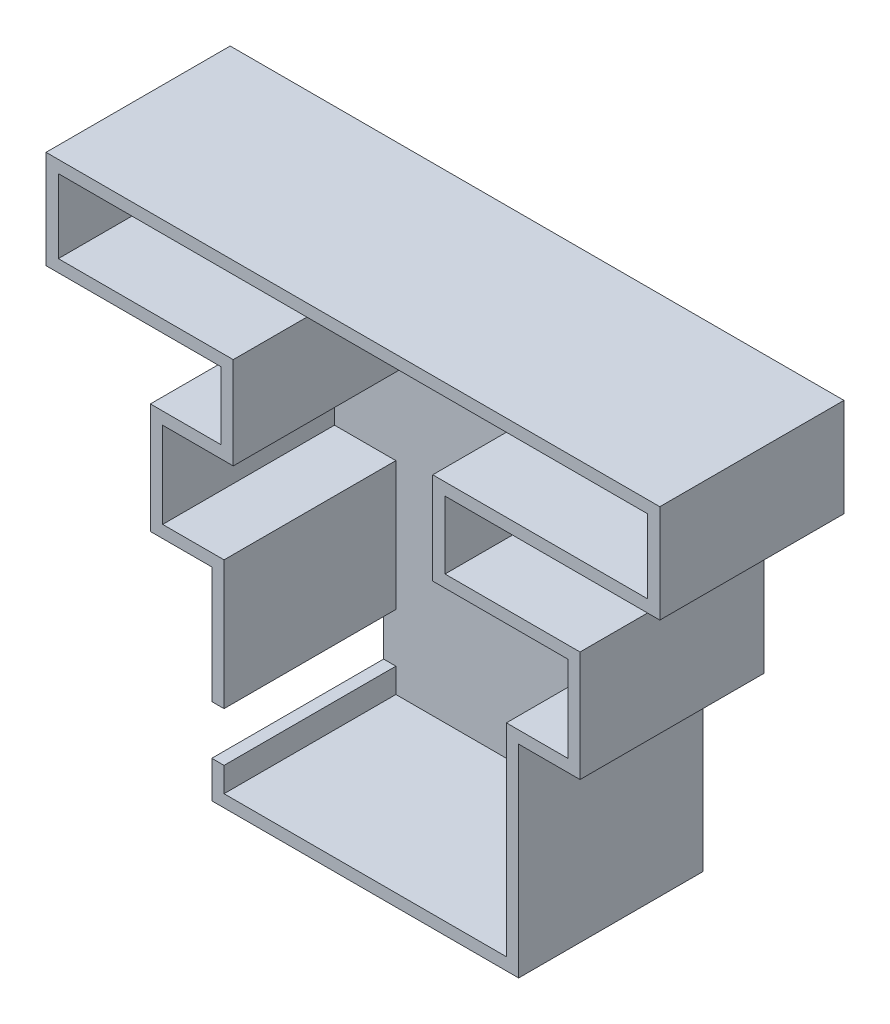
ISO-10303-21;
HEADER;
FILE_DESCRIPTION(('STEP AP214'),'2;1');
FILE_NAME('part.step','',(''),(''),'','','');
FILE_SCHEMA(('AUTOMOTIVE_DESIGN { 1 0 10303 214 1 1 1 1 }'));
ENDSEC;
DATA;
#1=APPLICATION_CONTEXT('core data for automotive mechanical design processes');
#2=APPLICATION_PROTOCOL_DEFINITION('international standard','automotive_design',2000,#1);
#3=PRODUCT_CONTEXT('',#1,'mechanical');
#4=PRODUCT('Part','Part','',(#3));
#5=PRODUCT_RELATED_PRODUCT_CATEGORY('part','',(#4));
#6=PRODUCT_DEFINITION_FORMATION('','',#4);
#7=PRODUCT_DEFINITION_CONTEXT('part definition',#1,'design');
#8=PRODUCT_DEFINITION('design','',#6,#7);
#9=PRODUCT_DEFINITION_SHAPE('','',#8);
#10=(LENGTH_UNIT() NAMED_UNIT(*) SI_UNIT(.MILLI.,.METRE.));
#11=(NAMED_UNIT(*) PLANE_ANGLE_UNIT() SI_UNIT($,.RADIAN.));
#12=(NAMED_UNIT(*) SI_UNIT($,.STERADIAN.) SOLID_ANGLE_UNIT());
#13=UNCERTAINTY_MEASURE_WITH_UNIT(LENGTH_MEASURE(1.E-05),#10,'distance_accuracy_value','');
#14=(GEOMETRIC_REPRESENTATION_CONTEXT(3) GLOBAL_UNCERTAINTY_ASSIGNED_CONTEXT((#13)) GLOBAL_UNIT_ASSIGNED_CONTEXT((#10,
#11,#12)) REPRESENTATION_CONTEXT('',''));
#15=CARTESIAN_POINT('',(0.,0.,0.));
#16=DIRECTION('',(0.,0.,1.));
#17=DIRECTION('',(1.,0.,0.));
#18=AXIS2_PLACEMENT_3D('',#15,#16,#17);
#19=CARTESIAN_POINT('',(-12.5,-1.,15.));
#20=DIRECTION('',(1.,0.,0.));
#21=DIRECTION('',(0.,0.,-1.));
#22=AXIS2_PLACEMENT_3D('',#19,#20,#21);
#23=PLANE('',#22);
#24=DIRECTION('',(0.,0.,1.));
#25=VECTOR('',#24,1.);
#26=CARTESIAN_POINT('',(-12.5,-10.5,1.));
#27=LINE('',#26,#25);
#28=CARTESIAN_POINT('',(-12.5,-10.5,1.));
#29=VERTEX_POINT('',#28);
#30=CARTESIAN_POINT('',(-12.5,-10.5,15.));
#31=VERTEX_POINT('',#30);
#32=EDGE_CURVE('E288',#29,#31,#27,.T.);
#33=ORIENTED_EDGE('',*,*,#32,.T.);
#34=DIRECTION('',(0.,-1.,0.));
#35=VECTOR('',#34,1.);
#36=CARTESIAN_POINT('',(-12.5,-1.,15.));
#37=LINE('',#36,#35);
#38=CARTESIAN_POINT('',(-12.5,-1.,15.));
#39=VERTEX_POINT('',#38);
#40=EDGE_CURVE('E306',#39,#31,#37,.T.);
#41=ORIENTED_EDGE('',*,*,#40,.F.);
#42=DIRECTION('',(0.,0.,-1.));
#43=VECTOR('',#42,1.);
#44=CARTESIAN_POINT('',(-12.5,-1.,15.));
#45=LINE('',#44,#43);
#46=CARTESIAN_POINT('',(-12.5,-1.,0.));
#47=VERTEX_POINT('',#46);
#48=EDGE_CURVE('E11',#39,#47,#45,.T.);
#49=ORIENTED_EDGE('',*,*,#48,.T.);
#50=DIRECTION('',(0.,-1.,0.));
#51=VECTOR('',#50,1.);
#52=CARTESIAN_POINT('',(-12.5,-1.,0.));
#53=LINE('',#52,#51);
#54=CARTESIAN_POINT('',(-12.5,-17.5,0.));
#55=VERTEX_POINT('',#54);
#56=EDGE_CURVE('E371',#47,#55,#53,.T.);
#57=ORIENTED_EDGE('',*,*,#56,.T.);
#58=DIRECTION('',(0.,0.,-1.));
#59=VECTOR('',#58,1.);
#60=CARTESIAN_POINT('',(-12.5,-17.5,15.));
#61=LINE('',#60,#59);
#62=CARTESIAN_POINT('',(-12.5,-17.5,15.));
#63=VERTEX_POINT('',#62);
#64=EDGE_CURVE('E54',#63,#55,#61,.T.);
#65=ORIENTED_EDGE('',*,*,#64,.F.);
#66=CARTESIAN_POINT('',(-12.5,-14.5,15.));
#67=VERTEX_POINT('',#66);
#68=EDGE_CURVE('E294',#67,#63,#37,.T.);
#69=ORIENTED_EDGE('',*,*,#68,.F.);
#70=DIRECTION('',(0.,0.,1.));
#71=VECTOR('',#70,1.);
#72=CARTESIAN_POINT('',(-12.5,-14.5,1.));
#73=LINE('',#72,#71);
#74=CARTESIAN_POINT('',(-12.5,-14.5,1.));
#75=VERTEX_POINT('',#74);
#76=EDGE_CURVE('E279',#75,#67,#73,.T.);
#77=ORIENTED_EDGE('',*,*,#76,.F.);
#78=DIRECTION('',(0.,-1.,0.));
#79=VECTOR('',#78,1.);
#80=CARTESIAN_POINT('',(-12.5,-10.5,1.));
#81=LINE('',#80,#79);
#82=EDGE_CURVE('E300',#29,#75,#81,.T.);
#83=ORIENTED_EDGE('',*,*,#82,.F.);
#84=EDGE_LOOP('',(#33,#41,#49,#57,#65,#69,#77,#83));
#85=FACE_BOUND('',#84,.T.);
#86=ADVANCED_FACE('F45',(#85),#23,.F.);
#87=CARTESIAN_POINT('',(0.,0.,15.));
#88=DIRECTION('',(0.,0.,-1.));
#89=DIRECTION('',(-1.,0.,0.));
#90=AXIS2_PLACEMENT_3D('',#87,#88,#89);
#91=PLANE('',#90);
#92=DIRECTION('',(-1.,0.,0.));
#93=VECTOR('',#92,1.);
#94=CARTESIAN_POINT('',(3.06021977856103,-10.5,15.));
#95=LINE('',#94,#93);
#96=CARTESIAN_POINT('',(-11.5,-10.5,15.));
#97=VERTEX_POINT('',#96);
#98=EDGE_CURVE('E299',#97,#31,#95,.T.);
#99=ORIENTED_EDGE('',*,*,#98,.F.);
#100=DIRECTION('',(0.,-1.,0.));
#101=VECTOR('',#100,1.);
#102=CARTESIAN_POINT('',(-11.5,0.,15.));
#103=LINE('',#102,#101);
#104=CARTESIAN_POINT('',(-11.5,0.,15.));
#105=VERTEX_POINT('',#104);
#106=EDGE_CURVE('E542',#105,#97,#103,.T.);
#107=ORIENTED_EDGE('',*,*,#106,.F.);
#108=DIRECTION('',(1.,0.,0.));
#109=VECTOR('',#108,1.);
#110=CARTESIAN_POINT('',(-16.5,0.,15.));
#111=LINE('',#110,#109);
#112=CARTESIAN_POINT('',(-16.5,0.,15.));
#113=VERTEX_POINT('',#112);
#114=EDGE_CURVE('E563',#113,#105,#111,.T.);
#115=ORIENTED_EDGE('',*,*,#114,.F.);
#116=DIRECTION('',(0.,-1.,0.));
#117=VECTOR('',#116,1.);
#118=CARTESIAN_POINT('',(-16.5,7.,15.));
#119=LINE('',#118,#117);
#120=CARTESIAN_POINT('',(-16.5,7.,15.));
#121=VERTEX_POINT('',#120);
#122=EDGE_CURVE('E672',#121,#113,#119,.T.);
#123=ORIENTED_EDGE('',*,*,#122,.F.);
#124=DIRECTION('',(-1.,0.,0.));
#125=VECTOR('',#124,1.);
#126=CARTESIAN_POINT('',(-10.75,7.,15.));
#127=LINE('',#126,#125);
#128=CARTESIAN_POINT('',(-10.75,7.,15.));
#129=VERTEX_POINT('',#128);
#130=EDGE_CURVE('E669',#129,#121,#127,.T.);
#131=ORIENTED_EDGE('',*,*,#130,.F.);
#132=DIRECTION('',(0.,-1.,0.));
#133=VECTOR('',#132,1.);
#134=CARTESIAN_POINT('',(-10.75,14.5,15.));
#135=LINE('',#134,#133);
#136=CARTESIAN_POINT('',(-10.75,14.5,15.));
#137=VERTEX_POINT('',#136);
#138=EDGE_CURVE('E665',#137,#129,#135,.T.);
#139=ORIENTED_EDGE('',*,*,#138,.F.);
#140=DIRECTION('',(1.,0.,0.));
#141=VECTOR('',#140,1.);
#142=CARTESIAN_POINT('',(-25.,14.5,15.));
#143=LINE('',#142,#141);
#144=CARTESIAN_POINT('',(-25.,14.5,15.));
#145=VERTEX_POINT('',#144);
#146=EDGE_CURVE('E661',#145,#137,#143,.T.);
#147=ORIENTED_EDGE('',*,*,#146,.F.);
#148=DIRECTION('',(0.,-1.,0.));
#149=VECTOR('',#148,1.);
#150=CARTESIAN_POINT('',(-25.,20.5,15.));
#151=LINE('',#150,#149);
#152=CARTESIAN_POINT('',(-25.,20.5,15.));
#153=VERTEX_POINT('',#152);
#154=EDGE_CURVE('E657',#153,#145,#151,.T.);
#155=ORIENTED_EDGE('',*,*,#154,.F.);
#156=DIRECTION('',(-1.,0.,0.));
#157=VECTOR('',#156,1.);
#158=CARTESIAN_POINT('',(23.,20.5,15.));
#159=LINE('',#158,#157);
#160=CARTESIAN_POINT('',(23.,20.5,15.));
#161=VERTEX_POINT('',#160);
#162=EDGE_CURVE('E653',#161,#153,#159,.T.);
#163=ORIENTED_EDGE('',*,*,#162,.F.);
#164=DIRECTION('',(0.,1.,0.));
#165=VECTOR('',#164,1.);
#166=CARTESIAN_POINT('',(23.,14.5,15.));
#167=LINE('',#166,#165);
#168=CARTESIAN_POINT('',(23.,14.5,15.));
#169=VERTEX_POINT('',#168);
#170=EDGE_CURVE('E650',#169,#161,#167,.T.);
#171=ORIENTED_EDGE('',*,*,#170,.F.);
#172=DIRECTION('',(1.,0.,0.));
#173=VECTOR('',#172,1.);
#174=CARTESIAN_POINT('',(5.5,14.5,15.));
#175=LINE('',#174,#173);
#176=CARTESIAN_POINT('',(5.5,14.5,15.));
#177=VERTEX_POINT('',#176);
#178=EDGE_CURVE('E586',#177,#169,#175,.T.);
#179=ORIENTED_EDGE('',*,*,#178,.F.);
#180=DIRECTION('',(0.,1.,0.));
#181=VECTOR('',#180,1.);
#182=CARTESIAN_POINT('',(5.5,7.,15.));
#183=LINE('',#182,#181);
#184=CARTESIAN_POINT('',(5.5,7.,15.));
#185=VERTEX_POINT('',#184);
#186=EDGE_CURVE('E582',#185,#177,#183,.T.);
#187=ORIENTED_EDGE('',*,*,#186,.F.);
#188=DIRECTION('',(-1.,0.,0.));
#189=VECTOR('',#188,1.);
#190=CARTESIAN_POINT('',(16.5,7.,15.));
#191=LINE('',#190,#189);
#192=CARTESIAN_POINT('',(16.5,7.,15.));
#193=VERTEX_POINT('',#192);
#194=EDGE_CURVE('E578',#193,#185,#191,.T.);
#195=ORIENTED_EDGE('',*,*,#194,.F.);
#196=DIRECTION('',(0.,1.,0.));
#197=VECTOR('',#196,1.);
#198=CARTESIAN_POINT('',(16.5,0.,15.));
#199=LINE('',#198,#197);
#200=CARTESIAN_POINT('',(16.5,0.,15.));
#201=VERTEX_POINT('',#200);
#202=EDGE_CURVE('E574',#201,#193,#199,.T.);
#203=ORIENTED_EDGE('',*,*,#202,.F.);
#204=DIRECTION('',(1.,0.,0.));
#205=VECTOR('',#204,1.);
#206=CARTESIAN_POINT('',(11.5,0.,15.));
#207=LINE('',#206,#205);
#208=CARTESIAN_POINT('',(11.5,0.,15.));
#209=VERTEX_POINT('',#208);
#210=EDGE_CURVE('E570',#209,#201,#207,.T.);
#211=ORIENTED_EDGE('',*,*,#210,.F.);
#212=DIRECTION('',(0.,1.,0.));
#213=VECTOR('',#212,1.);
#214=CARTESIAN_POINT('',(11.5,-16.5,15.));
#215=LINE('',#214,#213);
#216=CARTESIAN_POINT('',(11.5,-16.5,15.));
#217=VERTEX_POINT('',#216);
#218=EDGE_CURVE('E561',#217,#209,#215,.T.);
#219=ORIENTED_EDGE('',*,*,#218,.F.);
#220=DIRECTION('',(1.,0.,0.));
#221=VECTOR('',#220,1.);
#222=CARTESIAN_POINT('',(-11.5,-16.5,15.));
#223=LINE('',#222,#221);
#224=CARTESIAN_POINT('',(-11.5,-16.5,15.));
#225=VERTEX_POINT('',#224);
#226=EDGE_CURVE('E556',#225,#217,#223,.T.);
#227=ORIENTED_EDGE('',*,*,#226,.F.);
#228=CARTESIAN_POINT('',(-11.5,-14.5,15.));
#229=VERTEX_POINT('',#228);
#230=EDGE_CURVE('E297',#229,#225,#103,.T.);
#231=ORIENTED_EDGE('',*,*,#230,.F.);
#232=DIRECTION('',(-1.,0.,0.));
#233=VECTOR('',#232,1.);
#234=CARTESIAN_POINT('',(3.06021977856103,-14.5,15.));
#235=LINE('',#234,#233);
#236=EDGE_CURVE('E282',#229,#67,#235,.T.);
#237=ORIENTED_EDGE('',*,*,#236,.T.);
#238=ORIENTED_EDGE('',*,*,#68,.T.);
#239=DIRECTION('',(1.,0.,0.));
#240=VECTOR('',#239,1.);
#241=CARTESIAN_POINT('',(-12.5,-17.5,15.));
#242=LINE('',#241,#240);
#243=CARTESIAN_POINT('',(12.5,-17.5,15.));
#244=VERTEX_POINT('',#243);
#245=EDGE_CURVE('E312',#63,#244,#242,.T.);
#246=ORIENTED_EDGE('',*,*,#245,.T.);
#247=DIRECTION('',(0.,-1.,0.));
#248=VECTOR('',#247,1.);
#249=CARTESIAN_POINT('',(12.5,-1.,15.));
#250=LINE('',#249,#248);
#251=CARTESIAN_POINT('',(12.5,-1.,15.));
#252=VERTEX_POINT('',#251);
#253=EDGE_CURVE('E320',#252,#244,#250,.T.);
#254=ORIENTED_EDGE('',*,*,#253,.F.);
#255=DIRECTION('',(1.,0.,0.));
#256=VECTOR('',#255,1.);
#257=CARTESIAN_POINT('',(12.5,-1.,15.));
#258=LINE('',#257,#256);
#259=CARTESIAN_POINT('',(17.5,-1.,15.));
#260=VERTEX_POINT('',#259);
#261=EDGE_CURVE('E324',#252,#260,#258,.T.);
#262=ORIENTED_EDGE('',*,*,#261,.T.);
#263=DIRECTION('',(0.,-1.,0.));
#264=VECTOR('',#263,1.);
#265=CARTESIAN_POINT('',(17.5,8.,15.));
#266=LINE('',#265,#264);
#267=CARTESIAN_POINT('',(17.5,8.,15.));
#268=VERTEX_POINT('',#267);
#269=EDGE_CURVE('E327',#268,#260,#266,.T.);
#270=ORIENTED_EDGE('',*,*,#269,.F.);
#271=DIRECTION('',(1.,0.,0.));
#272=VECTOR('',#271,1.);
#273=CARTESIAN_POINT('',(6.5,8.,15.));
#274=LINE('',#273,#272);
#275=CARTESIAN_POINT('',(6.5,8.,15.));
#276=VERTEX_POINT('',#275);
#277=EDGE_CURVE('E331',#276,#268,#274,.T.);
#278=ORIENTED_EDGE('',*,*,#277,.F.);
#279=DIRECTION('',(0.,-1.,0.));
#280=VECTOR('',#279,1.);
#281=CARTESIAN_POINT('',(6.5,13.5,15.));
#282=LINE('',#281,#280);
#283=CARTESIAN_POINT('',(6.5,13.5,15.));
#284=VERTEX_POINT('',#283);
#285=EDGE_CURVE('E335',#284,#276,#282,.T.);
#286=ORIENTED_EDGE('',*,*,#285,.F.);
#287=DIRECTION('',(1.,0.,0.));
#288=VECTOR('',#287,1.);
#289=CARTESIAN_POINT('',(6.5,13.5,15.));
#290=LINE('',#289,#288);
#291=CARTESIAN_POINT('',(24.,13.5,15.));
#292=VERTEX_POINT('',#291);
#293=EDGE_CURVE('E339',#284,#292,#290,.T.);
#294=ORIENTED_EDGE('',*,*,#293,.T.);
#295=DIRECTION('',(0.,-1.,0.));
#296=VECTOR('',#295,1.);
#297=CARTESIAN_POINT('',(24.,21.5,15.));
#298=LINE('',#297,#296);
#299=CARTESIAN_POINT('',(24.,21.5,15.));
#300=VERTEX_POINT('',#299);
#301=EDGE_CURVE('E342',#300,#292,#298,.T.);
#302=ORIENTED_EDGE('',*,*,#301,.F.);
#303=DIRECTION('',(1.,0.,0.));
#304=VECTOR('',#303,1.);
#305=CARTESIAN_POINT('',(-26.,21.5,15.));
#306=LINE('',#305,#304);
#307=CARTESIAN_POINT('',(-26.,21.5,15.));
#308=VERTEX_POINT('',#307);
#309=EDGE_CURVE('E346',#308,#300,#306,.T.);
#310=ORIENTED_EDGE('',*,*,#309,.F.);
#311=DIRECTION('',(0.,-1.,0.));
#312=VECTOR('',#311,1.);
#313=CARTESIAN_POINT('',(-26.,21.5,15.));
#314=LINE('',#313,#312);
#315=CARTESIAN_POINT('',(-26.,13.5,15.));
#316=VERTEX_POINT('',#315);
#317=EDGE_CURVE('E350',#308,#316,#314,.T.);
#318=ORIENTED_EDGE('',*,*,#317,.T.);
#319=DIRECTION('',(1.,0.,0.));
#320=VECTOR('',#319,1.);
#321=CARTESIAN_POINT('',(-26.,13.5,15.));
#322=LINE('',#321,#320);
#323=CARTESIAN_POINT('',(-11.75,13.5,15.));
#324=VERTEX_POINT('',#323);
#325=EDGE_CURVE('E353',#316,#324,#322,.T.);
#326=ORIENTED_EDGE('',*,*,#325,.T.);
#327=DIRECTION('',(0.,-1.,0.));
#328=VECTOR('',#327,1.);
#329=CARTESIAN_POINT('',(-11.75,13.5,15.));
#330=LINE('',#329,#328);
#331=CARTESIAN_POINT('',(-11.75,8.,15.));
#332=VERTEX_POINT('',#331);
#333=EDGE_CURVE('E356',#324,#332,#330,.T.);
#334=ORIENTED_EDGE('',*,*,#333,.T.);
#335=DIRECTION('',(1.,0.,0.));
#336=VECTOR('',#335,1.);
#337=CARTESIAN_POINT('',(-17.5,8.,15.));
#338=LINE('',#337,#336);
#339=CARTESIAN_POINT('',(-17.5,8.,15.));
#340=VERTEX_POINT('',#339);
#341=EDGE_CURVE('E359',#340,#332,#338,.T.);
#342=ORIENTED_EDGE('',*,*,#341,.F.);
#343=DIRECTION('',(0.,-1.,0.));
#344=VECTOR('',#343,1.);
#345=CARTESIAN_POINT('',(-17.5,8.,15.));
#346=LINE('',#345,#344);
#347=CARTESIAN_POINT('',(-17.5,-1.,15.));
#348=VERTEX_POINT('',#347);
#349=EDGE_CURVE('E363',#340,#348,#346,.T.);
#350=ORIENTED_EDGE('',*,*,#349,.T.);
#351=DIRECTION('',(1.,0.,0.));
#352=VECTOR('',#351,1.);
#353=CARTESIAN_POINT('',(-17.5,-1.,15.));
#354=LINE('',#353,#352);
#355=EDGE_CURVE('E307',#348,#39,#354,.T.);
#356=ORIENTED_EDGE('',*,*,#355,.T.);
#357=ORIENTED_EDGE('',*,*,#40,.T.);
#358=EDGE_LOOP('',(#99,#107,#115,#123,#131,#139,#147,#155,#163,#171,#179,#187,#195,#203,#211,
#219,#227,#231,#237,#238,#246,#254,#262,#270,#278,#286,#294,#302,#310,#318,#326,#334,#342,#350,
#356,#357));
#359=FACE_BOUND('',#358,.T.);
#360=ADVANCED_FACE('F293',(#359),#91,.F.);
#361=CARTESIAN_POINT('',(-11.5,0.,0.999999999999999));
#362=DIRECTION('',(-1.,0.,0.));
#363=DIRECTION('',(0.,0.,1.));
#364=AXIS2_PLACEMENT_3D('',#361,#362,#363);
#365=PLANE('',#364);
#366=DIRECTION('',(0.,0.,-1.));
#367=VECTOR('',#366,1.);
#368=CARTESIAN_POINT('',(-11.5,-10.5,1.));
#369=LINE('',#368,#367);
#370=CARTESIAN_POINT('',(-11.5,-10.5,1.));
#371=VERTEX_POINT('',#370);
#372=EDGE_CURVE('E551',#97,#371,#369,.T.);
#373=ORIENTED_EDGE('',*,*,#372,.T.);
#374=DIRECTION('',(0.,-1.,0.));
#375=VECTOR('',#374,1.);
#376=CARTESIAN_POINT('',(-11.5,0.,0.999999999999999));
#377=LINE('',#376,#375);
#378=CARTESIAN_POINT('',(-11.5,0.,0.999999999999999));
#379=VERTEX_POINT('',#378);
#380=EDGE_CURVE('E837',#379,#371,#377,.T.);
#381=ORIENTED_EDGE('',*,*,#380,.F.);
#382=DIRECTION('',(0.,0.,1.));
#383=VECTOR('',#382,1.);
#384=CARTESIAN_POINT('',(-11.5,0.,0.999999999999999));
#385=LINE('',#384,#383);
#386=EDGE_CURVE('E553',#379,#105,#385,.T.);
#387=ORIENTED_EDGE('',*,*,#386,.T.);
#388=ORIENTED_EDGE('',*,*,#106,.T.);
#389=EDGE_LOOP('',(#373,#381,#387,#388));
#390=FACE_BOUND('',#389,.T.);
#391=ADVANCED_FACE('F549',(#390),#365,.F.);
#392=CARTESIAN_POINT('',(-17.5,-1.,15.));
#393=DIRECTION('',(0.,1.,0.));
#394=DIRECTION('',(0.,0.,1.));
#395=AXIS2_PLACEMENT_3D('',#392,#393,#394);
#396=PLANE('',#395);
#397=DIRECTION('',(1.,0.,0.));
#398=VECTOR('',#397,1.);
#399=CARTESIAN_POINT('',(-17.5,-1.,0.));
#400=LINE('',#399,#398);
#401=CARTESIAN_POINT('',(-17.5,-1.,0.));
#402=VERTEX_POINT('',#401);
#403=EDGE_CURVE('E367',#402,#47,#400,.T.);
#404=ORIENTED_EDGE('',*,*,#403,.T.);
#405=ORIENTED_EDGE('',*,*,#48,.F.);
#406=ORIENTED_EDGE('',*,*,#355,.F.);
#407=DIRECTION('',(0.,0.,-1.));
#408=VECTOR('',#407,1.);
#409=CARTESIAN_POINT('',(-17.5,-1.,15.));
#410=LINE('',#409,#408);
#411=EDGE_CURVE('E366',#348,#402,#410,.T.);
#412=ORIENTED_EDGE('',*,*,#411,.T.);
#413=EDGE_LOOP('',(#404,#405,#406,#412));
#414=FACE_BOUND('',#413,.T.);
#415=ADVANCED_FACE('F47',(#414),#396,.F.);
#416=CARTESIAN_POINT('',(-12.5,-17.5,15.));
#417=DIRECTION('',(0.,1.,0.));
#418=DIRECTION('',(0.,0.,1.));
#419=AXIS2_PLACEMENT_3D('',#416,#417,#418);
#420=PLANE('',#419);
#421=DIRECTION('',(1.,0.,0.));
#422=VECTOR('',#421,1.);
#423=CARTESIAN_POINT('',(-12.5,-17.5,0.));
#424=LINE('',#423,#422);
#425=CARTESIAN_POINT('',(12.5,-17.5,0.));
#426=VERTEX_POINT('',#425);
#427=EDGE_CURVE('E375',#55,#426,#424,.T.);
#428=ORIENTED_EDGE('',*,*,#427,.T.);
#429=DIRECTION('',(0.,0.,-1.));
#430=VECTOR('',#429,1.);
#431=CARTESIAN_POINT('',(12.5,-17.5,15.));
#432=LINE('',#431,#430);
#433=EDGE_CURVE('E468',#244,#426,#432,.T.);
#434=ORIENTED_EDGE('',*,*,#433,.F.);
#435=ORIENTED_EDGE('',*,*,#245,.F.);
#436=ORIENTED_EDGE('',*,*,#64,.T.);
#437=EDGE_LOOP('',(#428,#434,#435,#436));
#438=FACE_BOUND('',#437,.T.);
#439=ADVANCED_FACE('F473',(#438),#420,.F.);
#440=CARTESIAN_POINT('',(12.5,-1.,15.));
#441=DIRECTION('',(1.,0.,0.));
#442=DIRECTION('',(0.,1.,0.));
#443=AXIS2_PLACEMENT_3D('',#440,#441,#442);
#444=PLANE('',#443);
#445=DIRECTION('',(0.,-1.,0.));
#446=VECTOR('',#445,1.);
#447=CARTESIAN_POINT('',(12.5,-1.,0.));
#448=LINE('',#447,#446);
#449=CARTESIAN_POINT('',(12.5,-1.,0.));
#450=VERTEX_POINT('',#449);
#451=EDGE_CURVE('E379',#450,#426,#448,.T.);
#452=ORIENTED_EDGE('',*,*,#451,.F.);
#453=DIRECTION('',(0.,0.,-1.));
#454=VECTOR('',#453,1.);
#455=CARTESIAN_POINT('',(12.5,-1.,15.));
#456=LINE('',#455,#454);
#457=EDGE_CURVE('E465',#252,#450,#456,.T.);
#458=ORIENTED_EDGE('',*,*,#457,.F.);
#459=ORIENTED_EDGE('',*,*,#253,.T.);
#460=ORIENTED_EDGE('',*,*,#433,.T.);
#461=EDGE_LOOP('',(#452,#458,#459,#460));
#462=FACE_BOUND('',#461,.T.);
#463=ADVANCED_FACE('F481',(#462),#444,.T.);
#464=CARTESIAN_POINT('',(12.5,-1.,15.));
#465=DIRECTION('',(0.,1.,0.));
#466=DIRECTION('',(0.,0.,1.));
#467=AXIS2_PLACEMENT_3D('',#464,#465,#466);
#468=PLANE('',#467);
#469=DIRECTION('',(1.,0.,0.));
#470=VECTOR('',#469,1.);
#471=CARTESIAN_POINT('',(12.5,-1.,0.));
#472=LINE('',#471,#470);
#473=CARTESIAN_POINT('',(17.5,-1.,0.));
#474=VERTEX_POINT('',#473);
#475=EDGE_CURVE('E383',#450,#474,#472,.T.);
#476=ORIENTED_EDGE('',*,*,#475,.T.);
#477=DIRECTION('',(0.,0.,-1.));
#478=VECTOR('',#477,1.);
#479=CARTESIAN_POINT('',(17.5,-1.,15.));
#480=LINE('',#479,#478);
#481=EDGE_CURVE('E462',#260,#474,#480,.T.);
#482=ORIENTED_EDGE('',*,*,#481,.F.);
#483=ORIENTED_EDGE('',*,*,#261,.F.);
#484=ORIENTED_EDGE('',*,*,#457,.T.);
#485=EDGE_LOOP('',(#476,#482,#483,#484));
#486=FACE_BOUND('',#485,.T.);
#487=ADVANCED_FACE('F488',(#486),#468,.F.);
#488=CARTESIAN_POINT('',(17.5,8.,15.));
#489=DIRECTION('',(1.,0.,0.));
#490=DIRECTION('',(0.,0.,-1.));
#491=AXIS2_PLACEMENT_3D('',#488,#489,#490);
#492=PLANE('',#491);
#493=DIRECTION('',(0.,-1.,0.));
#494=VECTOR('',#493,1.);
#495=CARTESIAN_POINT('',(17.5,8.,0.));
#496=LINE('',#495,#494);
#497=CARTESIAN_POINT('',(17.5,8.,0.));
#498=VERTEX_POINT('',#497);
#499=EDGE_CURVE('E387',#498,#474,#496,.T.);
#500=ORIENTED_EDGE('',*,*,#499,.F.);
#501=DIRECTION('',(0.,0.,-1.));
#502=VECTOR('',#501,1.);
#503=CARTESIAN_POINT('',(17.5,8.,15.));
#504=LINE('',#503,#502);
#505=EDGE_CURVE('E459',#268,#498,#504,.T.);
#506=ORIENTED_EDGE('',*,*,#505,.F.);
#507=ORIENTED_EDGE('',*,*,#269,.T.);
#508=ORIENTED_EDGE('',*,*,#481,.T.);
#509=EDGE_LOOP('',(#500,#506,#507,#508));
#510=FACE_BOUND('',#509,.T.);
#511=ADVANCED_FACE('F491',(#510),#492,.T.);
#512=CARTESIAN_POINT('',(6.5,8.,15.));
#513=DIRECTION('',(0.,1.,0.));
#514=DIRECTION('',(0.,0.,1.));
#515=AXIS2_PLACEMENT_3D('',#512,#513,#514);
#516=PLANE('',#515);
#517=DIRECTION('',(1.,0.,0.));
#518=VECTOR('',#517,1.);
#519=CARTESIAN_POINT('',(6.5,8.,0.));
#520=LINE('',#519,#518);
#521=CARTESIAN_POINT('',(6.5,8.,0.));
#522=VERTEX_POINT('',#521);
#523=EDGE_CURVE('E391',#522,#498,#520,.T.);
#524=ORIENTED_EDGE('',*,*,#523,.F.);
#525=DIRECTION('',(0.,0.,-1.));
#526=VECTOR('',#525,1.);
#527=CARTESIAN_POINT('',(6.5,8.,15.));
#528=LINE('',#527,#526);
#529=EDGE_CURVE('E456',#276,#522,#528,.T.);
#530=ORIENTED_EDGE('',*,*,#529,.F.);
#531=ORIENTED_EDGE('',*,*,#277,.T.);
#532=ORIENTED_EDGE('',*,*,#505,.T.);
#533=EDGE_LOOP('',(#524,#530,#531,#532));
#534=FACE_BOUND('',#533,.T.);
#535=ADVANCED_FACE('F494',(#534),#516,.T.);
#536=CARTESIAN_POINT('',(6.5,13.5,15.));
#537=DIRECTION('',(1.,0.,0.));
#538=DIRECTION('',(0.,0.,-1.));
#539=AXIS2_PLACEMENT_3D('',#536,#537,#538);
#540=PLANE('',#539);
#541=DIRECTION('',(0.,-1.,0.));
#542=VECTOR('',#541,1.);
#543=CARTESIAN_POINT('',(6.5,13.5,0.));
#544=LINE('',#543,#542);
#545=CARTESIAN_POINT('',(6.5,13.5,0.));
#546=VERTEX_POINT('',#545);
#547=EDGE_CURVE('E395',#546,#522,#544,.T.);
#548=ORIENTED_EDGE('',*,*,#547,.F.);
#549=DIRECTION('',(0.,0.,-1.));
#550=VECTOR('',#549,1.);
#551=CARTESIAN_POINT('',(6.5,13.5,15.));
#552=LINE('',#551,#550);
#553=EDGE_CURVE('E453',#284,#546,#552,.T.);
#554=ORIENTED_EDGE('',*,*,#553,.F.);
#555=ORIENTED_EDGE('',*,*,#285,.T.);
#556=ORIENTED_EDGE('',*,*,#529,.T.);
#557=EDGE_LOOP('',(#548,#554,#555,#556));
#558=FACE_BOUND('',#557,.T.);
#559=ADVANCED_FACE('F498',(#558),#540,.T.);
#560=CARTESIAN_POINT('',(6.5,13.5,15.));
#561=DIRECTION('',(0.,1.,0.));
#562=DIRECTION('',(0.,0.,1.));
#563=AXIS2_PLACEMENT_3D('',#560,#561,#562);
#564=PLANE('',#563);
#565=DIRECTION('',(1.,0.,0.));
#566=VECTOR('',#565,1.);
#567=CARTESIAN_POINT('',(6.5,13.5,0.));
#568=LINE('',#567,#566);
#569=CARTESIAN_POINT('',(24.,13.5,0.));
#570=VERTEX_POINT('',#569);
#571=EDGE_CURVE('E399',#546,#570,#568,.T.);
#572=ORIENTED_EDGE('',*,*,#571,.T.);
#573=DIRECTION('',(0.,0.,-1.));
#574=VECTOR('',#573,1.);
#575=CARTESIAN_POINT('',(24.,13.5,15.));
#576=LINE('',#575,#574);
#577=EDGE_CURVE('E450',#292,#570,#576,.T.);
#578=ORIENTED_EDGE('',*,*,#577,.F.);
#579=ORIENTED_EDGE('',*,*,#293,.F.);
#580=ORIENTED_EDGE('',*,*,#553,.T.);
#581=EDGE_LOOP('',(#572,#578,#579,#580));
#582=FACE_BOUND('',#581,.T.);
#583=ADVANCED_FACE('F503',(#582),#564,.F.);
#584=CARTESIAN_POINT('',(24.,21.5,15.));
#585=DIRECTION('',(1.,0.,0.));
#586=DIRECTION('',(0.,0.,-1.));
#587=AXIS2_PLACEMENT_3D('',#584,#585,#586);
#588=PLANE('',#587);
#589=DIRECTION('',(0.,-1.,0.));
#590=VECTOR('',#589,1.);
#591=CARTESIAN_POINT('',(24.,21.5,0.));
#592=LINE('',#591,#590);
#593=CARTESIAN_POINT('',(24.,21.5,0.));
#594=VERTEX_POINT('',#593);
#595=EDGE_CURVE('E403',#594,#570,#592,.T.);
#596=ORIENTED_EDGE('',*,*,#595,.F.);
#597=DIRECTION('',(0.,0.,-1.));
#598=VECTOR('',#597,1.);
#599=CARTESIAN_POINT('',(24.,21.5,15.));
#600=LINE('',#599,#598);
#601=EDGE_CURVE('E447',#300,#594,#600,.T.);
#602=ORIENTED_EDGE('',*,*,#601,.F.);
#603=ORIENTED_EDGE('',*,*,#301,.T.);
#604=ORIENTED_EDGE('',*,*,#577,.T.);
#605=EDGE_LOOP('',(#596,#602,#603,#604));
#606=FACE_BOUND('',#605,.T.);
#607=ADVANCED_FACE('F738',(#606),#588,.T.);
#608=CARTESIAN_POINT('',(-26.,21.5,15.));
#609=DIRECTION('',(0.,1.,0.));
#610=DIRECTION('',(0.,0.,1.));
#611=AXIS2_PLACEMENT_3D('',#608,#609,#610);
#612=PLANE('',#611);
#613=DIRECTION('',(1.,0.,0.));
#614=VECTOR('',#613,1.);
#615=CARTESIAN_POINT('',(-26.,21.5,0.));
#616=LINE('',#615,#614);
#617=CARTESIAN_POINT('',(-26.,21.5,0.));
#618=VERTEX_POINT('',#617);
#619=EDGE_CURVE('E407',#618,#594,#616,.T.);
#620=ORIENTED_EDGE('',*,*,#619,.F.);
#621=DIRECTION('',(0.,0.,-1.));
#622=VECTOR('',#621,1.);
#623=CARTESIAN_POINT('',(-26.,21.5,15.));
#624=LINE('',#623,#622);
#625=EDGE_CURVE('E444',#308,#618,#624,.T.);
#626=ORIENTED_EDGE('',*,*,#625,.F.);
#627=ORIENTED_EDGE('',*,*,#309,.T.);
#628=ORIENTED_EDGE('',*,*,#601,.T.);
#629=EDGE_LOOP('',(#620,#626,#627,#628));
#630=FACE_BOUND('',#629,.T.);
#631=ADVANCED_FACE('F509',(#630),#612,.T.);
#632=CARTESIAN_POINT('',(-26.,21.5,15.));
#633=DIRECTION('',(1.,0.,0.));
#634=DIRECTION('',(0.,0.,-1.));
#635=AXIS2_PLACEMENT_3D('',#632,#633,#634);
#636=PLANE('',#635);
#637=DIRECTION('',(0.,-1.,0.));
#638=VECTOR('',#637,1.);
#639=CARTESIAN_POINT('',(-26.,21.5,0.));
#640=LINE('',#639,#638);
#641=CARTESIAN_POINT('',(-26.,13.5,0.));
#642=VERTEX_POINT('',#641);
#643=EDGE_CURVE('E411',#618,#642,#640,.T.);
#644=ORIENTED_EDGE('',*,*,#643,.T.);
#645=DIRECTION('',(0.,0.,-1.));
#646=VECTOR('',#645,1.);
#647=CARTESIAN_POINT('',(-26.,13.5,15.));
#648=LINE('',#647,#646);
#649=EDGE_CURVE('E440',#316,#642,#648,.T.);
#650=ORIENTED_EDGE('',*,*,#649,.F.);
#651=ORIENTED_EDGE('',*,*,#317,.F.);
#652=ORIENTED_EDGE('',*,*,#625,.T.);
#653=EDGE_LOOP('',(#644,#650,#651,#652));
#654=FACE_BOUND('',#653,.T.);
#655=ADVANCED_FACE('F515',(#654),#636,.F.);
#656=CARTESIAN_POINT('',(-26.,13.5,15.));
#657=DIRECTION('',(0.,1.,0.));
#658=DIRECTION('',(0.,0.,1.));
#659=AXIS2_PLACEMENT_3D('',#656,#657,#658);
#660=PLANE('',#659);
#661=DIRECTION('',(1.,0.,0.));
#662=VECTOR('',#661,1.);
#663=CARTESIAN_POINT('',(-26.,13.5,0.));
#664=LINE('',#663,#662);
#665=CARTESIAN_POINT('',(-11.75,13.5,0.));
#666=VERTEX_POINT('',#665);
#667=EDGE_CURVE('E414',#642,#666,#664,.T.);
#668=ORIENTED_EDGE('',*,*,#667,.T.);
#669=DIRECTION('',(0.,0.,-1.));
#670=VECTOR('',#669,1.);
#671=CARTESIAN_POINT('',(-11.75,13.5,15.));
#672=LINE('',#671,#670);
#673=EDGE_CURVE('E436',#324,#666,#672,.T.);
#674=ORIENTED_EDGE('',*,*,#673,.F.);
#675=ORIENTED_EDGE('',*,*,#325,.F.);
#676=ORIENTED_EDGE('',*,*,#649,.T.);
#677=EDGE_LOOP('',(#668,#674,#675,#676));
#678=FACE_BOUND('',#677,.T.);
#679=ADVANCED_FACE('F522',(#678),#660,.F.);
#680=CARTESIAN_POINT('',(-11.75,13.5,15.));
#681=DIRECTION('',(1.,0.,0.));
#682=DIRECTION('',(0.,0.,-1.));
#683=AXIS2_PLACEMENT_3D('',#680,#681,#682);
#684=PLANE('',#683);
#685=DIRECTION('',(0.,-1.,0.));
#686=VECTOR('',#685,1.);
#687=CARTESIAN_POINT('',(-11.75,13.5,0.));
#688=LINE('',#687,#686);
#689=CARTESIAN_POINT('',(-11.75,8.,0.));
#690=VERTEX_POINT('',#689);
#691=EDGE_CURVE('E417',#666,#690,#688,.T.);
#692=ORIENTED_EDGE('',*,*,#691,.T.);
#693=DIRECTION('',(0.,0.,-1.));
#694=VECTOR('',#693,1.);
#695=CARTESIAN_POINT('',(-11.75,8.,15.));
#696=LINE('',#695,#694);
#697=EDGE_CURVE('E433',#332,#690,#696,.T.);
#698=ORIENTED_EDGE('',*,*,#697,.F.);
#699=ORIENTED_EDGE('',*,*,#333,.F.);
#700=ORIENTED_EDGE('',*,*,#673,.T.);
#701=EDGE_LOOP('',(#692,#698,#699,#700));
#702=FACE_BOUND('',#701,.T.);
#703=ADVANCED_FACE('F526',(#702),#684,.F.);
#704=CARTESIAN_POINT('',(-17.5,8.,15.));
#705=DIRECTION('',(0.,1.,0.));
#706=DIRECTION('',(0.,0.,1.));
#707=AXIS2_PLACEMENT_3D('',#704,#705,#706);
#708=PLANE('',#707);
#709=DIRECTION('',(1.,0.,0.));
#710=VECTOR('',#709,1.);
#711=CARTESIAN_POINT('',(-17.5,8.,0.));
#712=LINE('',#711,#710);
#713=CARTESIAN_POINT('',(-17.5,8.,0.));
#714=VERTEX_POINT('',#713);
#715=EDGE_CURVE('E421',#714,#690,#712,.T.);
#716=ORIENTED_EDGE('',*,*,#715,.F.);
#717=DIRECTION('',(0.,0.,-1.));
#718=VECTOR('',#717,1.);
#719=CARTESIAN_POINT('',(-17.5,8.,15.));
#720=LINE('',#719,#718);
#721=EDGE_CURVE('E430',#340,#714,#720,.T.);
#722=ORIENTED_EDGE('',*,*,#721,.F.);
#723=ORIENTED_EDGE('',*,*,#341,.T.);
#724=ORIENTED_EDGE('',*,*,#697,.T.);
#725=EDGE_LOOP('',(#716,#722,#723,#724));
#726=FACE_BOUND('',#725,.T.);
#727=ADVANCED_FACE('F529',(#726),#708,.T.);
#728=CARTESIAN_POINT('',(-17.5,8.,15.));
#729=DIRECTION('',(1.,0.,0.));
#730=DIRECTION('',(0.,0.,-1.));
#731=AXIS2_PLACEMENT_3D('',#728,#729,#730);
#732=PLANE('',#731);
#733=DIRECTION('',(0.,-1.,0.));
#734=VECTOR('',#733,1.);
#735=CARTESIAN_POINT('',(-17.5,8.,0.));
#736=LINE('',#735,#734);
#737=EDGE_CURVE('E314',#714,#402,#736,.T.);
#738=ORIENTED_EDGE('',*,*,#737,.T.);
#739=ORIENTED_EDGE('',*,*,#411,.F.);
#740=ORIENTED_EDGE('',*,*,#349,.F.);
#741=ORIENTED_EDGE('',*,*,#721,.T.);
#742=EDGE_LOOP('',(#738,#739,#740,#741));
#743=FACE_BOUND('',#742,.T.);
#744=ADVANCED_FACE('F535',(#743),#732,.F.);
#745=CARTESIAN_POINT('',(0.,0.,0.));
#746=DIRECTION('',(0.,0.,-1.));
#747=DIRECTION('',(-1.,0.,0.));
#748=AXIS2_PLACEMENT_3D('',#745,#746,#747);
#749=PLANE('',#748);
#750=DIRECTION('',(-1.,0.,0.));
#751=VECTOR('',#750,1.);
#752=CARTESIAN_POINT('',(23.,20.5,0.));
#753=LINE('',#752,#751);
#754=CARTESIAN_POINT('',(23.,20.5,0.));
#755=VERTEX_POINT('',#754);
#756=CARTESIAN_POINT('',(-25.,20.5,0.));
#757=VERTEX_POINT('',#756);
#758=EDGE_CURVE('E802',#755,#757,#753,.T.);
#759=ORIENTED_EDGE('',*,*,#758,.T.);
#760=DIRECTION('',(0.,-1.,0.));
#761=VECTOR('',#760,1.);
#762=CARTESIAN_POINT('',(-25.,20.5,0.));
#763=LINE('',#762,#761);
#764=CARTESIAN_POINT('',(-25.,14.5,0.));
#765=VERTEX_POINT('',#764);
#766=EDGE_CURVE('E704',#757,#765,#763,.T.);
#767=ORIENTED_EDGE('',*,*,#766,.T.);
#768=DIRECTION('',(1.,0.,0.));
#769=VECTOR('',#768,1.);
#770=CARTESIAN_POINT('',(-25.,14.5,0.));
#771=LINE('',#770,#769);
#772=CARTESIAN_POINT('',(23.,14.5,0.));
#773=VERTEX_POINT('',#772);
#774=EDGE_CURVE('E819',#765,#773,#771,.T.);
#775=ORIENTED_EDGE('',*,*,#774,.T.);
#776=DIRECTION('',(0.,1.,0.));
#777=VECTOR('',#776,1.);
#778=CARTESIAN_POINT('',(23.,14.5,0.));
#779=LINE('',#778,#777);
#780=EDGE_CURVE('E654',#773,#755,#779,.T.);
#781=ORIENTED_EDGE('',*,*,#780,.T.);
#782=EDGE_LOOP('',(#759,#767,#775,#781));
#783=FACE_BOUND('',#782,.T.);
#784=ORIENTED_EDGE('',*,*,#403,.F.);
#785=ORIENTED_EDGE('',*,*,#737,.F.);
#786=ORIENTED_EDGE('',*,*,#715,.T.);
#787=ORIENTED_EDGE('',*,*,#691,.F.);
#788=ORIENTED_EDGE('',*,*,#667,.F.);
#789=ORIENTED_EDGE('',*,*,#643,.F.);
#790=ORIENTED_EDGE('',*,*,#619,.T.);
#791=ORIENTED_EDGE('',*,*,#595,.T.);
#792=ORIENTED_EDGE('',*,*,#571,.F.);
#793=ORIENTED_EDGE('',*,*,#547,.T.);
#794=ORIENTED_EDGE('',*,*,#523,.T.);
#795=ORIENTED_EDGE('',*,*,#499,.T.);
#796=ORIENTED_EDGE('',*,*,#475,.F.);
#797=ORIENTED_EDGE('',*,*,#451,.T.);
#798=ORIENTED_EDGE('',*,*,#427,.F.);
#799=ORIENTED_EDGE('',*,*,#56,.F.);
#800=EDGE_LOOP('',(#784,#785,#786,#787,#788,#789,#790,#791,#792,#793,#794,#795,#796,#797,#798,#799));
#801=FACE_BOUND('',#800,.T.);
#802=ADVANCED_FACE('F477',(#783,#801),#749,.T.);
#803=CARTESIAN_POINT('',(23.,14.5,0.999999999999999));
#804=DIRECTION('',(1.,0.,0.));
#805=DIRECTION('',(0.,0.,-1.));
#806=AXIS2_PLACEMENT_3D('',#803,#804,#805);
#807=PLANE('',#806);
#808=ORIENTED_EDGE('',*,*,#170,.T.);
#809=DIRECTION('',(0.,0.,1.));
#810=VECTOR('',#809,1.);
#811=CARTESIAN_POINT('',(23.,20.5,0.999999999999999));
#812=LINE('',#811,#810);
#813=EDGE_CURVE('E69',#755,#161,#812,.T.);
#814=ORIENTED_EDGE('',*,*,#813,.F.);
#815=ORIENTED_EDGE('',*,*,#780,.F.);
#816=DIRECTION('',(0.,0.,1.));
#817=VECTOR('',#816,1.);
#818=CARTESIAN_POINT('',(23.,14.5,0.999999999999999));
#819=LINE('',#818,#817);
#820=EDGE_CURVE('E372',#773,#169,#819,.T.);
#821=ORIENTED_EDGE('',*,*,#820,.T.);
#822=EDGE_LOOP('',(#808,#814,#815,#821));
#823=FACE_BOUND('',#822,.T.);
#824=ADVANCED_FACE('F754',(#823),#807,.F.);
#825=CARTESIAN_POINT('',(5.5,14.5,0.999999999999999));
#826=DIRECTION('',(0.,-1.,0.));
#827=DIRECTION('',(0.,0.,-1.));
#828=AXIS2_PLACEMENT_3D('',#825,#826,#827);
#829=PLANE('',#828);
#830=ORIENTED_EDGE('',*,*,#178,.T.);
#831=ORIENTED_EDGE('',*,*,#820,.F.);
#832=ORIENTED_EDGE('',*,*,#774,.F.);
#833=DIRECTION('',(0.,0.,1.));
#834=VECTOR('',#833,1.);
#835=CARTESIAN_POINT('',(-25.,14.5,0.999999999999999));
#836=LINE('',#835,#834);
#837=EDGE_CURVE('E629',#765,#145,#836,.T.);
#838=ORIENTED_EDGE('',*,*,#837,.T.);
#839=ORIENTED_EDGE('',*,*,#146,.T.);
#840=DIRECTION('',(0.,0.,1.));
#841=VECTOR('',#840,1.);
#842=CARTESIAN_POINT('',(-10.75,14.5,0.999999999999999));
#843=LINE('',#842,#841);
#844=CARTESIAN_POINT('',(-10.75,14.5,0.999999999999999));
#845=VERTEX_POINT('',#844);
#846=EDGE_CURVE('E626',#845,#137,#843,.T.);
#847=ORIENTED_EDGE('',*,*,#846,.F.);
#848=DIRECTION('',(1.,0.,0.));
#849=VECTOR('',#848,1.);
#850=CARTESIAN_POINT('',(-25.,14.5,0.999999999999999));
#851=LINE('',#850,#849);
#852=CARTESIAN_POINT('',(5.5,14.5,0.999999999999999));
#853=VERTEX_POINT('',#852);
#854=EDGE_CURVE('E766',#845,#853,#851,.T.);
#855=ORIENTED_EDGE('',*,*,#854,.T.);
#856=DIRECTION('',(0.,0.,1.));
#857=VECTOR('',#856,1.);
#858=CARTESIAN_POINT('',(5.5,14.5,0.999999999999999));
#859=LINE('',#858,#857);
#860=EDGE_CURVE('E593',#853,#177,#859,.T.);
#861=ORIENTED_EDGE('',*,*,#860,.T.);
#862=EDGE_LOOP('',(#830,#831,#832,#838,#839,#847,#855,#861));
#863=FACE_BOUND('',#862,.T.);
#864=ADVANCED_FACE('F696',(#863),#829,.F.);
#865=CARTESIAN_POINT('',(5.5,7.,0.999999999999999));
#866=DIRECTION('',(1.,0.,0.));
#867=DIRECTION('',(0.,0.,-1.));
#868=AXIS2_PLACEMENT_3D('',#865,#866,#867);
#869=PLANE('',#868);
#870=ORIENTED_EDGE('',*,*,#186,.T.);
#871=ORIENTED_EDGE('',*,*,#860,.F.);
#872=DIRECTION('',(0.,1.,0.));
#873=VECTOR('',#872,1.);
#874=CARTESIAN_POINT('',(5.5,7.,0.999999999999999));
#875=LINE('',#874,#873);
#876=CARTESIAN_POINT('',(5.5,7.,0.999999999999999));
#877=VERTEX_POINT('',#876);
#878=EDGE_CURVE('E635',#877,#853,#875,.T.);
#879=ORIENTED_EDGE('',*,*,#878,.F.);
#880=DIRECTION('',(0.,0.,1.));
#881=VECTOR('',#880,1.);
#882=CARTESIAN_POINT('',(5.5,7.,0.999999999999999));
#883=LINE('',#882,#881);
#884=EDGE_CURVE('E596',#877,#185,#883,.T.);
#885=ORIENTED_EDGE('',*,*,#884,.T.);
#886=EDGE_LOOP('',(#870,#871,#879,#885));
#887=FACE_BOUND('',#886,.T.);
#888=ADVANCED_FACE('F760',(#887),#869,.F.);
#889=CARTESIAN_POINT('',(16.5,7.,0.999999999999999));
#890=DIRECTION('',(0.,1.,0.));
#891=DIRECTION('',(0.,0.,1.));
#892=AXIS2_PLACEMENT_3D('',#889,#890,#891);
#893=PLANE('',#892);
#894=ORIENTED_EDGE('',*,*,#194,.T.);
#895=ORIENTED_EDGE('',*,*,#884,.F.);
#896=DIRECTION('',(-1.,0.,0.));
#897=VECTOR('',#896,1.);
#898=CARTESIAN_POINT('',(16.5,7.,0.999999999999999));
#899=LINE('',#898,#897);
#900=CARTESIAN_POINT('',(16.5,7.,0.999999999999999));
#901=VERTEX_POINT('',#900);
#902=EDGE_CURVE('E641',#901,#877,#899,.T.);
#903=ORIENTED_EDGE('',*,*,#902,.F.);
#904=DIRECTION('',(0.,0.,1.));
#905=VECTOR('',#904,1.);
#906=CARTESIAN_POINT('',(16.5,7.,0.999999999999999));
#907=LINE('',#906,#905);
#908=EDGE_CURVE('E599',#901,#193,#907,.T.);
#909=ORIENTED_EDGE('',*,*,#908,.T.);
#910=EDGE_LOOP('',(#894,#895,#903,#909));
#911=FACE_BOUND('',#910,.T.);
#912=ADVANCED_FACE('F770',(#911),#893,.F.);
#913=CARTESIAN_POINT('',(16.5,0.,0.999999999999999));
#914=DIRECTION('',(1.,0.,0.));
#915=DIRECTION('',(0.,0.,-1.));
#916=AXIS2_PLACEMENT_3D('',#913,#914,#915);
#917=PLANE('',#916);
#918=ORIENTED_EDGE('',*,*,#202,.T.);
#919=ORIENTED_EDGE('',*,*,#908,.F.);
#920=DIRECTION('',(0.,1.,0.));
#921=VECTOR('',#920,1.);
#922=CARTESIAN_POINT('',(16.5,0.,0.999999999999999));
#923=LINE('',#922,#921);
#924=CARTESIAN_POINT('',(16.5,0.,0.999999999999999));
#925=VERTEX_POINT('',#924);
#926=EDGE_CURVE('E646',#925,#901,#923,.T.);
#927=ORIENTED_EDGE('',*,*,#926,.F.);
#928=DIRECTION('',(0.,0.,1.));
#929=VECTOR('',#928,1.);
#930=CARTESIAN_POINT('',(16.5,0.,0.999999999999999));
#931=LINE('',#930,#929);
#932=EDGE_CURVE('E602',#925,#201,#931,.T.);
#933=ORIENTED_EDGE('',*,*,#932,.T.);
#934=EDGE_LOOP('',(#918,#919,#927,#933));
#935=FACE_BOUND('',#934,.T.);
#936=ADVANCED_FACE('F775',(#935),#917,.F.);
#937=CARTESIAN_POINT('',(11.5,0.,0.999999999999999));
#938=DIRECTION('',(0.,-1.,0.));
#939=DIRECTION('',(0.,0.,-1.));
#940=AXIS2_PLACEMENT_3D('',#937,#938,#939);
#941=PLANE('',#940);
#942=ORIENTED_EDGE('',*,*,#210,.T.);
#943=ORIENTED_EDGE('',*,*,#932,.F.);
#944=DIRECTION('',(1.,0.,0.));
#945=VECTOR('',#944,1.);
#946=CARTESIAN_POINT('',(11.5,0.,0.999999999999999));
#947=LINE('',#946,#945);
#948=CARTESIAN_POINT('',(11.5,0.,0.999999999999999));
#949=VERTEX_POINT('',#948);
#950=EDGE_CURVE('E782',#949,#925,#947,.T.);
#951=ORIENTED_EDGE('',*,*,#950,.F.);
#952=DIRECTION('',(0.,0.,1.));
#953=VECTOR('',#952,1.);
#954=CARTESIAN_POINT('',(11.5,0.,0.999999999999999));
#955=LINE('',#954,#953);
#956=EDGE_CURVE('E605',#949,#209,#955,.T.);
#957=ORIENTED_EDGE('',*,*,#956,.T.);
#958=EDGE_LOOP('',(#942,#943,#951,#957));
#959=FACE_BOUND('',#958,.T.);
#960=ADVANCED_FACE('F781',(#959),#941,.F.);
#961=CARTESIAN_POINT('',(11.5,-16.5,0.999999999999999));
#962=DIRECTION('',(1.,0.,0.));
#963=DIRECTION('',(0.,0.,-1.));
#964=AXIS2_PLACEMENT_3D('',#961,#962,#963);
#965=PLANE('',#964);
#966=ORIENTED_EDGE('',*,*,#218,.T.);
#967=ORIENTED_EDGE('',*,*,#956,.F.);
#968=DIRECTION('',(0.,1.,0.));
#969=VECTOR('',#968,1.);
#970=CARTESIAN_POINT('',(11.5,-16.5,0.999999999999999));
#971=LINE('',#970,#969);
#972=CARTESIAN_POINT('',(11.5,-16.5,0.999999999999999));
#973=VERTEX_POINT('',#972);
#974=EDGE_CURVE('E842',#973,#949,#971,.T.);
#975=ORIENTED_EDGE('',*,*,#974,.F.);
#976=DIRECTION('',(0.,0.,1.));
#977=VECTOR('',#976,1.);
#978=CARTESIAN_POINT('',(11.5,-16.5,0.999999999999999));
#979=LINE('',#978,#977);
#980=EDGE_CURVE('E608',#973,#217,#979,.T.);
#981=ORIENTED_EDGE('',*,*,#980,.T.);
#982=EDGE_LOOP('',(#966,#967,#975,#981));
#983=FACE_BOUND('',#982,.T.);
#984=ADVANCED_FACE('F786',(#983),#965,.F.);
#985=CARTESIAN_POINT('',(-11.5,-16.5,0.999999999999999));
#986=DIRECTION('',(0.,-1.,0.));
#987=DIRECTION('',(0.,0.,-1.));
#988=AXIS2_PLACEMENT_3D('',#985,#986,#987);
#989=PLANE('',#988);
#990=ORIENTED_EDGE('',*,*,#226,.T.);
#991=ORIENTED_EDGE('',*,*,#980,.F.);
#992=DIRECTION('',(1.,0.,0.));
#993=VECTOR('',#992,1.);
#994=CARTESIAN_POINT('',(-11.5,-16.5,0.999999999999999));
#995=LINE('',#994,#993);
#996=CARTESIAN_POINT('',(-11.5,-16.5,0.999999999999999));
#997=VERTEX_POINT('',#996);
#998=EDGE_CURVE('E792',#997,#973,#995,.T.);
#999=ORIENTED_EDGE('',*,*,#998,.F.);
#1000=DIRECTION('',(0.,0.,1.));
#1001=VECTOR('',#1000,1.);
#1002=CARTESIAN_POINT('',(-11.5,-16.5,0.999999999999999));
#1003=LINE('',#1002,#1001);
#1004=EDGE_CURVE('E611',#997,#225,#1003,.T.);
#1005=ORIENTED_EDGE('',*,*,#1004,.T.);
#1006=EDGE_LOOP('',(#990,#991,#999,#1005));
#1007=FACE_BOUND('',#1006,.T.);
#1008=ADVANCED_FACE('F788',(#1007),#989,.F.);
#1009=CARTESIAN_POINT('',(-11.5,-14.5,0.999999999999999));
#1010=VERTEX_POINT('',#1009);
#1011=EDGE_CURVE('E796',#1010,#997,#377,.T.);
#1012=ORIENTED_EDGE('',*,*,#1011,.F.);
#1013=DIRECTION('',(0.,0.,-1.));
#1014=VECTOR('',#1013,1.);
#1015=CARTESIAN_POINT('',(-11.5,-14.5,1.));
#1016=LINE('',#1015,#1014);
#1017=EDGE_CURVE('E797',#229,#1010,#1016,.T.);
#1018=ORIENTED_EDGE('',*,*,#1017,.F.);
#1019=ORIENTED_EDGE('',*,*,#230,.T.);
#1020=ORIENTED_EDGE('',*,*,#1004,.F.);
#1021=EDGE_LOOP('',(#1012,#1018,#1019,#1020));
#1022=FACE_BOUND('',#1021,.T.);
#1023=ADVANCED_FACE('F795',(#1022),#365,.F.);
#1024=CARTESIAN_POINT('',(-16.5,0.,0.999999999999999));
#1025=DIRECTION('',(0.,-1.,0.));
#1026=DIRECTION('',(0.,0.,-1.));
#1027=AXIS2_PLACEMENT_3D('',#1024,#1025,#1026);
#1028=PLANE('',#1027);
#1029=ORIENTED_EDGE('',*,*,#114,.T.);
#1030=ORIENTED_EDGE('',*,*,#386,.F.);
#1031=DIRECTION('',(1.,0.,0.));
#1032=VECTOR('',#1031,1.);
#1033=CARTESIAN_POINT('',(-16.5,0.,0.999999999999999));
#1034=LINE('',#1033,#1032);
#1035=CARTESIAN_POINT('',(-16.5,0.,0.999999999999999));
#1036=VERTEX_POINT('',#1035);
#1037=EDGE_CURVE('E833',#1036,#379,#1034,.T.);
#1038=ORIENTED_EDGE('',*,*,#1037,.F.);
#1039=DIRECTION('',(0.,0.,1.));
#1040=VECTOR('',#1039,1.);
#1041=CARTESIAN_POINT('',(-16.5,0.,0.999999999999999));
#1042=LINE('',#1041,#1040);
#1043=EDGE_CURVE('E617',#1036,#113,#1042,.T.);
#1044=ORIENTED_EDGE('',*,*,#1043,.T.);
#1045=EDGE_LOOP('',(#1029,#1030,#1038,#1044));
#1046=FACE_BOUND('',#1045,.T.);
#1047=ADVANCED_FACE('F679',(#1046),#1028,.F.);
#1048=CARTESIAN_POINT('',(-16.5,7.,0.999999999999999));
#1049=DIRECTION('',(-1.,0.,0.));
#1050=DIRECTION('',(0.,0.,1.));
#1051=AXIS2_PLACEMENT_3D('',#1048,#1049,#1050);
#1052=PLANE('',#1051);
#1053=ORIENTED_EDGE('',*,*,#122,.T.);
#1054=ORIENTED_EDGE('',*,*,#1043,.F.);
#1055=DIRECTION('',(0.,-1.,0.));
#1056=VECTOR('',#1055,1.);
#1057=CARTESIAN_POINT('',(-16.5,7.,0.999999999999999));
#1058=LINE('',#1057,#1056);
#1059=CARTESIAN_POINT('',(-16.5,7.,0.999999999999999));
#1060=VERTEX_POINT('',#1059);
#1061=EDGE_CURVE('E829',#1060,#1036,#1058,.T.);
#1062=ORIENTED_EDGE('',*,*,#1061,.F.);
#1063=DIRECTION('',(0.,0.,1.));
#1064=VECTOR('',#1063,1.);
#1065=CARTESIAN_POINT('',(-16.5,7.,0.999999999999999));
#1066=LINE('',#1065,#1064);
#1067=EDGE_CURVE('E620',#1060,#121,#1066,.T.);
#1068=ORIENTED_EDGE('',*,*,#1067,.T.);
#1069=EDGE_LOOP('',(#1053,#1054,#1062,#1068));
#1070=FACE_BOUND('',#1069,.T.);
#1071=ADVANCED_FACE('F848',(#1070),#1052,.F.);
#1072=CARTESIAN_POINT('',(-10.75,7.,0.999999999999999));
#1073=DIRECTION('',(0.,1.,0.));
#1074=DIRECTION('',(0.,0.,1.));
#1075=AXIS2_PLACEMENT_3D('',#1072,#1073,#1074);
#1076=PLANE('',#1075);
#1077=ORIENTED_EDGE('',*,*,#130,.T.);
#1078=ORIENTED_EDGE('',*,*,#1067,.F.);
#1079=DIRECTION('',(-1.,0.,0.));
#1080=VECTOR('',#1079,1.);
#1081=CARTESIAN_POINT('',(-10.75,7.,0.999999999999999));
#1082=LINE('',#1081,#1080);
#1083=CARTESIAN_POINT('',(-10.75,7.,0.999999999999999));
#1084=VERTEX_POINT('',#1083);
#1085=EDGE_CURVE('E689',#1084,#1060,#1082,.T.);
#1086=ORIENTED_EDGE('',*,*,#1085,.F.);
#1087=DIRECTION('',(0.,0.,1.));
#1088=VECTOR('',#1087,1.);
#1089=CARTESIAN_POINT('',(-10.75,7.,0.999999999999999));
#1090=LINE('',#1089,#1088);
#1091=EDGE_CURVE('E623',#1084,#129,#1090,.T.);
#1092=ORIENTED_EDGE('',*,*,#1091,.T.);
#1093=EDGE_LOOP('',(#1077,#1078,#1086,#1092));
#1094=FACE_BOUND('',#1093,.T.);
#1095=ADVANCED_FACE('F685',(#1094),#1076,.F.);
#1096=CARTESIAN_POINT('',(-10.75,14.5,0.999999999999999));
#1097=DIRECTION('',(-1.,0.,0.));
#1098=DIRECTION('',(0.,0.,1.));
#1099=AXIS2_PLACEMENT_3D('',#1096,#1097,#1098);
#1100=PLANE('',#1099);
#1101=ORIENTED_EDGE('',*,*,#138,.T.);
#1102=ORIENTED_EDGE('',*,*,#1091,.F.);
#1103=DIRECTION('',(0.,-1.,0.));
#1104=VECTOR('',#1103,1.);
#1105=CARTESIAN_POINT('',(-10.75,14.5,0.999999999999999));
#1106=LINE('',#1105,#1104);
#1107=EDGE_CURVE('E590',#845,#1084,#1106,.T.);
#1108=ORIENTED_EDGE('',*,*,#1107,.F.);
#1109=ORIENTED_EDGE('',*,*,#846,.T.);
#1110=EDGE_LOOP('',(#1101,#1102,#1108,#1109));
#1111=FACE_BOUND('',#1110,.T.);
#1112=ADVANCED_FACE('F693',(#1111),#1100,.F.);
#1113=CARTESIAN_POINT('',(-25.,20.5,0.999999999999999));
#1114=DIRECTION('',(-1.,0.,0.));
#1115=DIRECTION('',(0.,0.,1.));
#1116=AXIS2_PLACEMENT_3D('',#1113,#1114,#1115);
#1117=PLANE('',#1116);
#1118=ORIENTED_EDGE('',*,*,#154,.T.);
#1119=ORIENTED_EDGE('',*,*,#837,.F.);
#1120=ORIENTED_EDGE('',*,*,#766,.F.);
#1121=DIRECTION('',(0.,0.,1.));
#1122=VECTOR('',#1121,1.);
#1123=CARTESIAN_POINT('',(-25.,20.5,0.999999999999999));
#1124=LINE('',#1123,#1122);
#1125=EDGE_CURVE('E632',#757,#153,#1124,.T.);
#1126=ORIENTED_EDGE('',*,*,#1125,.T.);
#1127=EDGE_LOOP('',(#1118,#1119,#1120,#1126));
#1128=FACE_BOUND('',#1127,.T.);
#1129=ADVANCED_FACE('F701',(#1128),#1117,.F.);
#1130=CARTESIAN_POINT('',(23.,20.5,0.999999999999999));
#1131=DIRECTION('',(0.,1.,0.));
#1132=DIRECTION('',(-1.,0.,0.));
#1133=AXIS2_PLACEMENT_3D('',#1130,#1131,#1132);
#1134=PLANE('',#1133);
#1135=ORIENTED_EDGE('',*,*,#162,.T.);
#1136=ORIENTED_EDGE('',*,*,#1125,.F.);
#1137=ORIENTED_EDGE('',*,*,#758,.F.);
#1138=ORIENTED_EDGE('',*,*,#813,.T.);
#1139=EDGE_LOOP('',(#1135,#1136,#1137,#1138));
#1140=FACE_BOUND('',#1139,.T.);
#1141=ADVANCED_FACE('F706',(#1140),#1134,.F.);
#1142=CARTESIAN_POINT('',(0.,0.,0.999999999999999));
#1143=DIRECTION('',(0.,0.,1.));
#1144=DIRECTION('',(1.,0.,0.));
#1145=AXIS2_PLACEMENT_3D('',#1142,#1143,#1144);
#1146=PLANE('',#1145);
#1147=ORIENTED_EDGE('',*,*,#854,.F.);
#1148=ORIENTED_EDGE('',*,*,#1107,.T.);
#1149=ORIENTED_EDGE('',*,*,#1085,.T.);
#1150=ORIENTED_EDGE('',*,*,#1061,.T.);
#1151=ORIENTED_EDGE('',*,*,#1037,.T.);
#1152=ORIENTED_EDGE('',*,*,#380,.T.);
#1153=DIRECTION('',(-1.,0.,0.));
#1154=VECTOR('',#1153,1.);
#1155=CARTESIAN_POINT('',(3.06021977856103,-10.5,1.));
#1156=LINE('',#1155,#1154);
#1157=EDGE_CURVE('E545',#371,#29,#1156,.T.);
#1158=ORIENTED_EDGE('',*,*,#1157,.T.);
#1159=ORIENTED_EDGE('',*,*,#82,.T.);
#1160=DIRECTION('',(-1.,0.,0.));
#1161=VECTOR('',#1160,1.);
#1162=CARTESIAN_POINT('',(3.06021977856103,-14.5,1.));
#1163=LINE('',#1162,#1161);
#1164=EDGE_CURVE('E61',#1010,#75,#1163,.T.);
#1165=ORIENTED_EDGE('',*,*,#1164,.F.);
#1166=ORIENTED_EDGE('',*,*,#1011,.T.);
#1167=ORIENTED_EDGE('',*,*,#998,.T.);
#1168=ORIENTED_EDGE('',*,*,#974,.T.);
#1169=ORIENTED_EDGE('',*,*,#950,.T.);
#1170=ORIENTED_EDGE('',*,*,#926,.T.);
#1171=ORIENTED_EDGE('',*,*,#902,.T.);
#1172=ORIENTED_EDGE('',*,*,#878,.T.);
#1173=EDGE_LOOP('',(#1147,#1148,#1149,#1150,#1151,#1152,#1158,#1159,#1165,#1166,#1167,#1168,
#1169,#1170,#1171,#1172));
#1174=FACE_BOUND('',#1173,.T.);
#1175=ADVANCED_FACE('F708',(#1174),#1146,.T.);
#1176=CARTESIAN_POINT('',(3.06021977856103,-10.5,1.));
#1177=DIRECTION('',(0.,-1.,0.));
#1178=DIRECTION('',(0.,0.,-1.));
#1179=AXIS2_PLACEMENT_3D('',#1176,#1177,#1178);
#1180=PLANE('',#1179);
#1181=ORIENTED_EDGE('',*,*,#98,.T.);
#1182=ORIENTED_EDGE('',*,*,#32,.F.);
#1183=ORIENTED_EDGE('',*,*,#1157,.F.);
#1184=ORIENTED_EDGE('',*,*,#372,.F.);
#1185=EDGE_LOOP('',(#1181,#1182,#1183,#1184));
#1186=FACE_BOUND('',#1185,.T.);
#1187=ADVANCED_FACE('F715',(#1186),#1180,.T.);
#1188=CARTESIAN_POINT('',(3.06021977856103,-14.5,1.));
#1189=DIRECTION('',(0.,-1.,0.));
#1190=DIRECTION('',(0.,0.,-1.));
#1191=AXIS2_PLACEMENT_3D('',#1188,#1189,#1190);
#1192=PLANE('',#1191);
#1193=ORIENTED_EDGE('',*,*,#1017,.T.);
#1194=ORIENTED_EDGE('',*,*,#1164,.T.);
#1195=ORIENTED_EDGE('',*,*,#76,.T.);
#1196=ORIENTED_EDGE('',*,*,#236,.F.);
#1197=EDGE_LOOP('',(#1193,#1194,#1195,#1196));
#1198=FACE_BOUND('',#1197,.T.);
#1199=ADVANCED_FACE('F281',(#1198),#1192,.F.);
#1200=CLOSED_SHELL('',(#86,#360,#391,#415,#439,#463,#487,#511,#535,#559,#583,#607,#631,#655,
#679,#703,#727,#744,#802,#824,#864,#888,#912,#936,#960,#984,#1008,#1023,#1047,#1071,#1095,#1112,
#1129,#1141,#1175,#1187,#1199));
#1201=MANIFOLD_SOLID_BREP('B2',#1200);
#1202=ADVANCED_BREP_SHAPE_REPRESENTATION('',(#18,#1201),#14);
#1203=SHAPE_DEFINITION_REPRESENTATION(#9,#1202);
ENDSEC;
END-ISO-10303-21;
